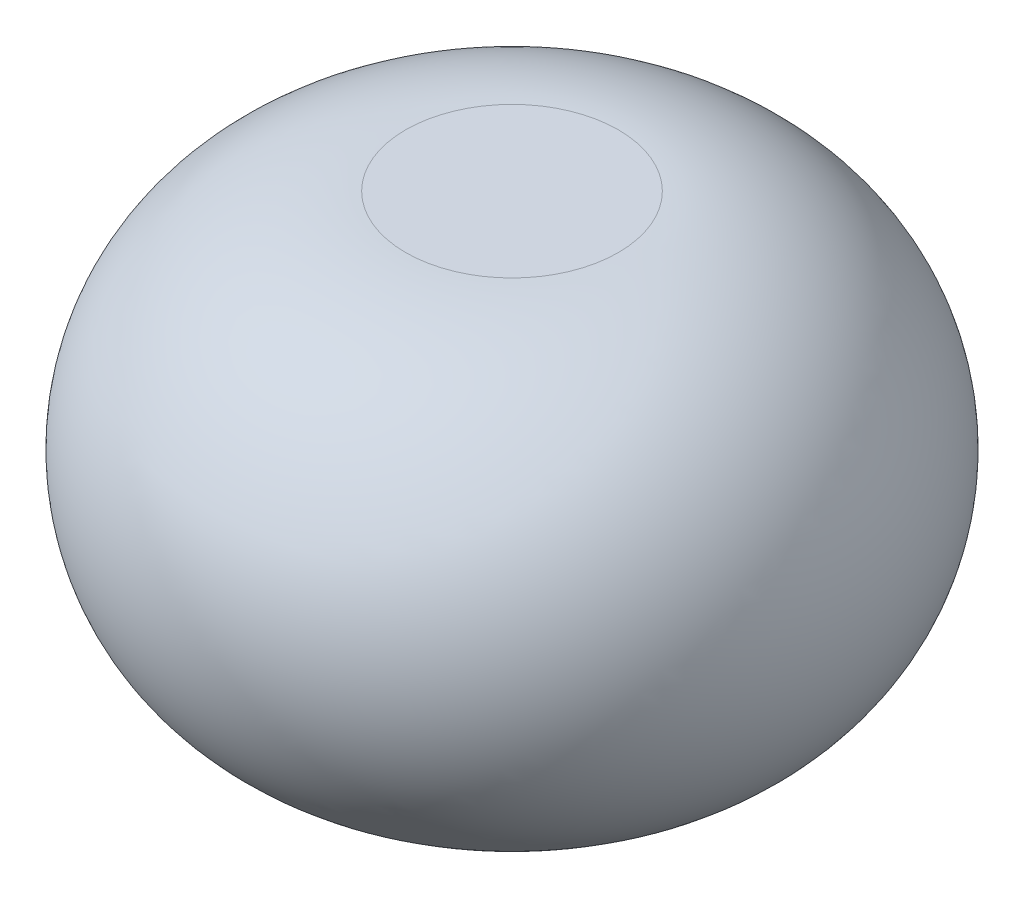
ISO-10303-21;
HEADER;
FILE_DESCRIPTION(('STEP AP214'),'2;1');
FILE_NAME('part.step','',(''),(''),'','','');
FILE_SCHEMA(('AUTOMOTIVE_DESIGN { 1 0 10303 214 1 1 1 1 }'));
ENDSEC;
DATA;
#1=APPLICATION_CONTEXT('core data for automotive mechanical design processes');
#2=APPLICATION_PROTOCOL_DEFINITION('international standard','automotive_design',2000,#1);
#3=PRODUCT_CONTEXT('',#1,'mechanical');
#4=PRODUCT('Part','Part','',(#3));
#5=PRODUCT_RELATED_PRODUCT_CATEGORY('part','',(#4));
#6=PRODUCT_DEFINITION_FORMATION('','',#4);
#7=PRODUCT_DEFINITION_CONTEXT('part definition',#1,'design');
#8=PRODUCT_DEFINITION('design','',#6,#7);
#9=PRODUCT_DEFINITION_SHAPE('','',#8);
#10=(LENGTH_UNIT() NAMED_UNIT(*) SI_UNIT(.MILLI.,.METRE.));
#11=(NAMED_UNIT(*) PLANE_ANGLE_UNIT() SI_UNIT($,.RADIAN.));
#12=(NAMED_UNIT(*) SI_UNIT($,.STERADIAN.) SOLID_ANGLE_UNIT());
#13=UNCERTAINTY_MEASURE_WITH_UNIT(LENGTH_MEASURE(1.E-05),#10,'distance_accuracy_value','');
#14=(GEOMETRIC_REPRESENTATION_CONTEXT(3) GLOBAL_UNCERTAINTY_ASSIGNED_CONTEXT((#13)) GLOBAL_UNIT_ASSIGNED_CONTEXT((#10,
#11,#12)) REPRESENTATION_CONTEXT('',''));
#15=CARTESIAN_POINT('',(0.,0.,0.));
#16=DIRECTION('',(0.,0.,1.));
#17=DIRECTION('',(1.,0.,0.));
#18=AXIS2_PLACEMENT_3D('',#15,#16,#17);
#19=CARTESIAN_POINT('',(0.,4200.,0.));
#20=DIRECTION('',(0.,-1.,0.));
#21=DIRECTION('',(0.,0.,-1.));
#22=AXIS2_PLACEMENT_3D('',#19,#20,#21);
#23=PLANE('',#22);
#24=CARTESIAN_POINT('',(0.,4200.,0.));
#25=DIRECTION('',(0.,-1.,0.));
#26=DIRECTION('',(0.,0.,-1.));
#27=AXIS2_PLACEMENT_3D('',#24,#25,#26);
#28=CIRCLE('',#27,1000.);
#29=CARTESIAN_POINT('',(0.,4200.,-1000.));
#30=VERTEX_POINT('',#29);
#31=EDGE_CURVE('E46',#30,#30,#28,.T.);
#32=ORIENTED_EDGE('',*,*,#31,.F.);
#33=EDGE_LOOP('',(#32));
#34=FACE_BOUND('',#33,.T.);
#35=ADVANCED_FACE('F34',(#34),#23,.F.);
#36=CARTESIAN_POINT('',(0.,2100.,0.));
#37=DIRECTION('',(0.,-1.,0.));
#38=DIRECTION('',(0.,0.,-1.));
#39=AXIS2_PLACEMENT_3D('',#36,#37,#38);
#40=DEGENERATE_TOROIDAL_SURFACE('',#39,1000.,2100.,.T.);
#41=CARTESIAN_POINT('',(0.,0.,0.));
#42=DIRECTION('',(0.,-1.,0.));
#43=DIRECTION('',(0.,0.,-1.));
#44=AXIS2_PLACEMENT_3D('',#41,#42,#43);
#45=CIRCLE('',#44,1000.);
#46=CARTESIAN_POINT('',(0.,0.,-1000.));
#47=VERTEX_POINT('',#46);
#48=EDGE_CURVE('E50',#47,#47,#45,.T.);
#49=ORIENTED_EDGE('',*,*,#48,.F.);
#50=EDGE_LOOP('',(#49));
#51=FACE_BOUND('',#50,.T.);
#52=ORIENTED_EDGE('',*,*,#31,.T.);
#53=EDGE_LOOP('',(#52));
#54=FACE_BOUND('',#53,.T.);
#55=ADVANCED_FACE('F58',(#51,#54),#40,.T.);
#56=CARTESIAN_POINT('',(0.,0.,0.));
#57=DIRECTION('',(0.,1.,0.));
#58=DIRECTION('',(0.,0.,1.));
#59=AXIS2_PLACEMENT_3D('',#56,#57,#58);
#60=PLANE('',#59);
#61=ORIENTED_EDGE('',*,*,#48,.T.);
#62=EDGE_LOOP('',(#61));
#63=FACE_BOUND('',#62,.T.);
#64=ADVANCED_FACE('F56',(#63),#60,.F.);
#65=CLOSED_SHELL('',(#35,#55,#64));
#66=CARTESIAN_POINT('',(0.,1.,0.));
#67=DIRECTION('',(0.,1.,0.));
#68=DIRECTION('',(0.,0.,1.));
#69=AXIS2_PLACEMENT_3D('',#66,#67,#68);
#70=PLANE('',#69);
#71=CARTESIAN_POINT('',(0.,1.,0.));
#72=DIRECTION('',(0.,-1.,0.));
#73=DIRECTION('',(0.,0.,-1.));
#74=AXIS2_PLACEMENT_3D('',#71,#72,#73);
#75=CIRCLE('',#74,1000.);
#76=CARTESIAN_POINT('',(0.,1.,-1000.));
#77=VERTEX_POINT('',#76);
#78=EDGE_CURVE('E10',#77,#77,#75,.T.);
#79=ORIENTED_EDGE('',*,*,#78,.F.);
#80=EDGE_LOOP('',(#79));
#81=FACE_BOUND('',#80,.T.);
#82=ADVANCED_FACE('F36',(#81),#70,.T.);
#83=CARTESIAN_POINT('',(0.,2100.,0.));
#84=DIRECTION('',(0.,-1.,0.));
#85=DIRECTION('',(0.,0.,-1.));
#86=AXIS2_PLACEMENT_3D('',#83,#84,#85);
#87=DEGENERATE_TOROIDAL_SURFACE('',#86,1000.,2099.,.T.);
#88=ORIENTED_EDGE('',*,*,#78,.T.);
#89=EDGE_LOOP('',(#88));
#90=FACE_BOUND('',#89,.T.);
#91=CARTESIAN_POINT('',(0.,4199.,0.));
#92=DIRECTION('',(0.,-1.,0.));
#93=DIRECTION('',(0.,0.,-1.));
#94=AXIS2_PLACEMENT_3D('',#91,#92,#93);
#95=CIRCLE('',#94,1000.);
#96=CARTESIAN_POINT('',(0.,4199.,-1000.));
#97=VERTEX_POINT('',#96);
#98=EDGE_CURVE('E42',#97,#97,#95,.T.);
#99=ORIENTED_EDGE('',*,*,#98,.F.);
#100=EDGE_LOOP('',(#99));
#101=FACE_BOUND('',#100,.T.);
#102=ADVANCED_FACE('F72',(#90,#101),#87,.F.);
#103=CARTESIAN_POINT('',(0.,4199.,0.));
#104=DIRECTION('',(0.,-1.,0.));
#105=DIRECTION('',(0.,0.,-1.));
#106=AXIS2_PLACEMENT_3D('',#103,#104,#105);
#107=PLANE('',#106);
#108=ORIENTED_EDGE('',*,*,#98,.T.);
#109=EDGE_LOOP('',(#108));
#110=FACE_BOUND('',#109,.T.);
#111=ADVANCED_FACE('F70',(#110),#107,.T.);
#112=CLOSED_SHELL('',(#82,#102,#111));
#113=ORIENTED_CLOSED_SHELL('',*,#112,.T.);
#114=BREP_WITH_VOIDS('B2',#65,(#113));
#115=ADVANCED_BREP_SHAPE_REPRESENTATION('',(#18,#114),#14);
#116=SHAPE_DEFINITION_REPRESENTATION(#9,#115);
ENDSEC;
END-ISO-10303-21;
